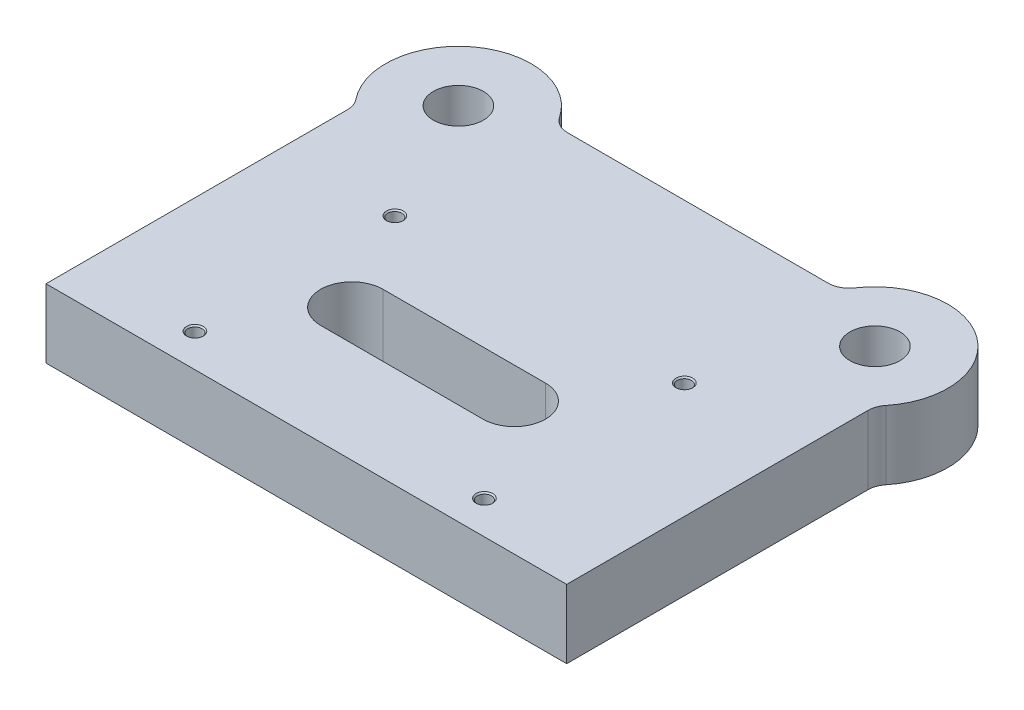
ISO-10303-21;
HEADER;
FILE_DESCRIPTION(('STEP AP214'),'2;1');
FILE_NAME('part.step','',(''),(''),'','','');
FILE_SCHEMA(('AUTOMOTIVE_DESIGN { 1 0 10303 214 1 1 1 1 }'));
ENDSEC;
DATA;
#1=APPLICATION_CONTEXT('core data for automotive mechanical design processes');
#2=APPLICATION_PROTOCOL_DEFINITION('international standard','automotive_design',2000,#1);
#3=PRODUCT_CONTEXT('',#1,'mechanical');
#4=PRODUCT('Part','Part','',(#3));
#5=PRODUCT_RELATED_PRODUCT_CATEGORY('part','',(#4));
#6=PRODUCT_DEFINITION_FORMATION('','',#4);
#7=PRODUCT_DEFINITION_CONTEXT('part definition',#1,'design');
#8=PRODUCT_DEFINITION('design','',#6,#7);
#9=PRODUCT_DEFINITION_SHAPE('','',#8);
#10=(LENGTH_UNIT() NAMED_UNIT(*) SI_UNIT(.MILLI.,.METRE.));
#11=(NAMED_UNIT(*) PLANE_ANGLE_UNIT() SI_UNIT($,.RADIAN.));
#12=(NAMED_UNIT(*) SI_UNIT($,.STERADIAN.) SOLID_ANGLE_UNIT());
#13=UNCERTAINTY_MEASURE_WITH_UNIT(LENGTH_MEASURE(1.E-05),#10,'distance_accuracy_value','');
#14=(GEOMETRIC_REPRESENTATION_CONTEXT(3) GLOBAL_UNCERTAINTY_ASSIGNED_CONTEXT((#13)) GLOBAL_UNIT_ASSIGNED_CONTEXT((#10,
#11,#12)) REPRESENTATION_CONTEXT('',''));
#15=CARTESIAN_POINT('',(0.,0.,0.));
#16=DIRECTION('',(0.,0.,1.));
#17=DIRECTION('',(1.,0.,0.));
#18=AXIS2_PLACEMENT_3D('',#15,#16,#17);
#19=CARTESIAN_POINT('',(-100.,33.,-173.));
#20=DIRECTION('',(0.,1.,0.));
#21=DIRECTION('',(0.,0.,1.));
#22=AXIS2_PLACEMENT_3D('',#19,#20,#21);
#23=PLANE('',#22);
#24=CARTESIAN_POINT('',(-41.7730554338695,33.,-63.6023744671545));
#25=DIRECTION('',(0.,1.,0.));
#26=DIRECTION('',(0.,0.,1.));
#27=AXIS2_PLACEMENT_3D('',#24,#25,#26);
#28=CIRCLE('',#27,15.);
#29=CARTESIAN_POINT('',(-41.7730554338695,33.,-78.6023744671545));
#30=VERTEX_POINT('',#29);
#31=CARTESIAN_POINT('',(-41.7730554338695,33.,-48.6023744671544));
#32=VERTEX_POINT('',#31);
#33=EDGE_CURVE('E55',#30,#32,#28,.T.);
#34=ORIENTED_EDGE('',*,*,#33,.F.);
#35=DIRECTION('',(-1.,0.,0.));
#36=VECTOR('',#35,1.);
#37=CARTESIAN_POINT('',(-41.7730554338695,33.,-78.6023744671545));
#38=LINE('',#37,#36);
#39=CARTESIAN_POINT('',(36.2269445661305,33.,-78.6023744671545));
#40=VERTEX_POINT('',#39);
#41=EDGE_CURVE('E149',#40,#30,#38,.T.);
#42=ORIENTED_EDGE('',*,*,#41,.F.);
#43=CARTESIAN_POINT('',(36.2269445661305,33.,-63.6023744671545));
#44=DIRECTION('',(0.,1.,0.));
#45=DIRECTION('',(0.,0.,1.));
#46=AXIS2_PLACEMENT_3D('',#43,#44,#45);
#47=CIRCLE('',#46,15.);
#48=CARTESIAN_POINT('',(36.2269445661305,33.,-48.6023744671544));
#49=VERTEX_POINT('',#48);
#50=EDGE_CURVE('E176',#49,#40,#47,.T.);
#51=ORIENTED_EDGE('',*,*,#50,.F.);
#52=DIRECTION('',(1.,0.,0.));
#53=VECTOR('',#52,1.);
#54=CARTESIAN_POINT('',(-41.7730554338695,33.,-48.6023744671544));
#55=LINE('',#54,#53);
#56=EDGE_CURVE('E168',#32,#49,#55,.T.);
#57=ORIENTED_EDGE('',*,*,#56,.F.);
#58=EDGE_LOOP('',(#34,#42,#51,#57));
#59=FACE_BOUND('',#58,.T.);
#60=CARTESIAN_POINT('',(-69.5,33.,-112.));
#61=DIRECTION('',(0.,1.,0.));
#62=DIRECTION('',(0.,0.,1.));
#63=AXIS2_PLACEMENT_3D('',#60,#61,#62);
#64=CIRCLE('',#63,4.025);
#65=CARTESIAN_POINT('',(-69.5,33.,-107.975));
#66=VERTEX_POINT('',#65);
#67=EDGE_CURVE('E156',#66,#66,#64,.T.);
#68=ORIENTED_EDGE('',*,*,#67,.F.);
#69=EDGE_LOOP('',(#68));
#70=FACE_BOUND('',#69,.T.);
#71=CARTESIAN_POINT('',(69.5,33.,-112.));
#72=DIRECTION('',(0.,1.,0.));
#73=DIRECTION('',(0.,0.,1.));
#74=AXIS2_PLACEMENT_3D('',#71,#72,#73);
#75=CIRCLE('',#74,4.025);
#76=CARTESIAN_POINT('',(69.5,33.,-107.975));
#77=VERTEX_POINT('',#76);
#78=EDGE_CURVE('E201',#77,#77,#75,.T.);
#79=ORIENTED_EDGE('',*,*,#78,.F.);
#80=EDGE_LOOP('',(#79));
#81=FACE_BOUND('',#80,.T.);
#82=CARTESIAN_POINT('',(69.5,33.,-16.));
#83=DIRECTION('',(0.,1.,0.));
#84=DIRECTION('',(0.,0.,1.));
#85=AXIS2_PLACEMENT_3D('',#82,#83,#84);
#86=CIRCLE('',#85,4.025);
#87=CARTESIAN_POINT('',(69.5,33.,-11.975));
#88=VERTEX_POINT('',#87);
#89=EDGE_CURVE('E213',#88,#88,#86,.T.);
#90=ORIENTED_EDGE('',*,*,#89,.F.);
#91=EDGE_LOOP('',(#90));
#92=FACE_BOUND('',#91,.T.);
#93=CARTESIAN_POINT('',(-69.5,33.,-16.));
#94=DIRECTION('',(0.,1.,0.));
#95=DIRECTION('',(0.,0.,1.));
#96=AXIS2_PLACEMENT_3D('',#93,#94,#95);
#97=CIRCLE('',#96,4.025);
#98=CARTESIAN_POINT('',(-69.5,33.,-11.975));
#99=VERTEX_POINT('',#98);
#100=EDGE_CURVE('E224',#99,#99,#97,.T.);
#101=ORIENTED_EDGE('',*,*,#100,.F.);
#102=EDGE_LOOP('',(#101));
#103=FACE_BOUND('',#102,.T.);
#104=CARTESIAN_POINT('',(-100.,33.,-173.));
#105=DIRECTION('',(0.,1.,0.));
#106=DIRECTION('',(0.,0.,1.));
#107=AXIS2_PLACEMENT_3D('',#104,#105,#106);
#108=CIRCLE('',#107,12.);
#109=CARTESIAN_POINT('',(-100.,33.,-161.));
#110=VERTEX_POINT('',#109);
#111=EDGE_CURVE('E245',#110,#110,#108,.T.);
#112=ORIENTED_EDGE('',*,*,#111,.F.);
#113=EDGE_LOOP('',(#112));
#114=FACE_BOUND('',#113,.T.);
#115=CARTESIAN_POINT('',(-100.,33.,-173.));
#116=DIRECTION('',(0.,1.,0.));
#117=DIRECTION('',(0.,0.,1.));
#118=AXIS2_PLACEMENT_3D('',#115,#116,#117);
#119=CIRCLE('',#118,35.);
#120=CARTESIAN_POINT('',(-70.8982203250916,33.,-192.444444444444));
#121=VERTEX_POINT('',#120);
#122=CARTESIAN_POINT('',(-127.222222222222,33.,-151.001122363085));
#123=VERTEX_POINT('',#122);
#124=EDGE_CURVE('E272',#121,#123,#119,.T.);
#125=ORIENTED_EDGE('',*,*,#124,.T.);
#126=CARTESIAN_POINT('',(-135.,33.,-144.715728752538));
#127=DIRECTION('',(0.,1.,0.));
#128=DIRECTION('',(0.,0.,1.));
#129=AXIS2_PLACEMENT_3D('',#126,#127,#128);
#130=CIRCLE('',#129,10.);
#131=CARTESIAN_POINT('',(-125.,33.,-144.715728752538));
#132=VERTEX_POINT('',#131);
#133=EDGE_CURVE('E11',#123,#132,#130,.F.);
#134=ORIENTED_EDGE('',*,*,#133,.T.);
#135=DIRECTION('',(0.,0.,1.));
#136=VECTOR('',#135,1.);
#137=CARTESIAN_POINT('',(-125.,33.,0.));
#138=LINE('',#137,#136);
#139=CARTESIAN_POINT('',(-125.,33.,0.));
#140=VERTEX_POINT('',#139);
#141=EDGE_CURVE('E253',#132,#140,#138,.T.);
#142=ORIENTED_EDGE('',*,*,#141,.T.);
#143=DIRECTION('',(1.,0.,0.));
#144=VECTOR('',#143,1.);
#145=CARTESIAN_POINT('',(125.,33.,0.));
#146=LINE('',#145,#144);
#147=CARTESIAN_POINT('',(125.,33.,0.));
#148=VERTEX_POINT('',#147);
#149=EDGE_CURVE('E256',#140,#148,#146,.T.);
#150=ORIENTED_EDGE('',*,*,#149,.T.);
#151=DIRECTION('',(0.,0.,-1.));
#152=VECTOR('',#151,1.);
#153=CARTESIAN_POINT('',(125.,33.,0.));
#154=LINE('',#153,#152);
#155=CARTESIAN_POINT('',(125.,33.,-144.715728752538));
#156=VERTEX_POINT('',#155);
#157=EDGE_CURVE('E260',#148,#156,#154,.T.);
#158=ORIENTED_EDGE('',*,*,#157,.T.);
#159=CARTESIAN_POINT('',(135.,33.,-144.715728752538));
#160=DIRECTION('',(0.,1.,0.));
#161=DIRECTION('',(0.,0.,1.));
#162=AXIS2_PLACEMENT_3D('',#159,#160,#161);
#163=CIRCLE('',#162,10.);
#164=CARTESIAN_POINT('',(127.222222222222,33.,-151.001122363085));
#165=VERTEX_POINT('',#164);
#166=EDGE_CURVE('E335',#156,#165,#163,.F.);
#167=ORIENTED_EDGE('',*,*,#166,.T.);
#168=CARTESIAN_POINT('',(100.,33.,-173.));
#169=DIRECTION('',(0.,1.,0.));
#170=DIRECTION('',(0.,0.,-1.));
#171=AXIS2_PLACEMENT_3D('',#168,#169,#170);
#172=CIRCLE('',#171,35.);
#173=CARTESIAN_POINT('',(70.8982203250916,33.,-192.444444444444));
#174=VERTEX_POINT('',#173);
#175=EDGE_CURVE('E264',#165,#174,#172,.T.);
#176=ORIENTED_EDGE('',*,*,#175,.T.);
#177=CARTESIAN_POINT('',(62.5834261322606,33.,-198.));
#178=DIRECTION('',(0.,1.,0.));
#179=DIRECTION('',(0.,0.,1.));
#180=AXIS2_PLACEMENT_3D('',#177,#178,#179);
#181=CIRCLE('',#180,10.);
#182=CARTESIAN_POINT('',(62.5834261322606,33.,-188.));
#183=VERTEX_POINT('',#182);
#184=EDGE_CURVE('E340',#174,#183,#181,.F.);
#185=ORIENTED_EDGE('',*,*,#184,.T.);
#186=DIRECTION('',(-1.,0.,0.));
#187=VECTOR('',#186,1.);
#188=CARTESIAN_POINT('',(68.3772233983162,33.,-188.));
#189=LINE('',#188,#187);
#190=CARTESIAN_POINT('',(-62.5834261322606,33.,-188.));
#191=VERTEX_POINT('',#190);
#192=EDGE_CURVE('E268',#183,#191,#189,.T.);
#193=ORIENTED_EDGE('',*,*,#192,.T.);
#194=CARTESIAN_POINT('',(-62.5834261322606,33.,-198.));
#195=DIRECTION('',(0.,1.,0.));
#196=DIRECTION('',(0.,0.,1.));
#197=AXIS2_PLACEMENT_3D('',#194,#195,#196);
#198=CIRCLE('',#197,10.);
#199=EDGE_CURVE('E346',#191,#121,#198,.F.);
#200=ORIENTED_EDGE('',*,*,#199,.T.);
#201=EDGE_LOOP('',(#125,#134,#142,#150,#158,#167,#176,#185,#193,#200));
#202=FACE_BOUND('',#201,.T.);
#203=CARTESIAN_POINT('',(100.,33.,-173.));
#204=DIRECTION('',(0.,1.,0.));
#205=DIRECTION('',(0.,0.,-1.));
#206=AXIS2_PLACEMENT_3D('',#203,#204,#205);
#207=CIRCLE('',#206,12.);
#208=CARTESIAN_POINT('',(100.,33.,-185.));
#209=VERTEX_POINT('',#208);
#210=EDGE_CURVE('E237',#209,#209,#207,.T.);
#211=ORIENTED_EDGE('',*,*,#210,.F.);
#212=EDGE_LOOP('',(#211));
#213=FACE_BOUND('',#212,.T.);
#214=ADVANCED_FACE('F39',(#59,#70,#81,#92,#103,#114,#202,#213),#23,.T.);
#215=CARTESIAN_POINT('',(-100.,0.,-173.));
#216=DIRECTION('',(0.,1.,0.));
#217=DIRECTION('',(0.,0.,1.));
#218=AXIS2_PLACEMENT_3D('',#215,#216,#217);
#219=PLANE('',#218);
#220=DIRECTION('',(1.,0.,0.));
#221=VECTOR('',#220,1.);
#222=CARTESIAN_POINT('',(-41.7730554338695,0.,-78.6023744671545));
#223=LINE('',#222,#221);
#224=CARTESIAN_POINT('',(-41.7730554338695,0.,-78.6023744671545));
#225=VERTEX_POINT('',#224);
#226=CARTESIAN_POINT('',(36.2269445661305,0.,-78.6023744671545));
#227=VERTEX_POINT('',#226);
#228=EDGE_CURVE('E162',#225,#227,#223,.T.);
#229=ORIENTED_EDGE('',*,*,#228,.F.);
#230=CARTESIAN_POINT('',(-41.7730554338695,0.,-63.6023744671545));
#231=DIRECTION('',(0.,1.,0.));
#232=DIRECTION('',(0.,0.,1.));
#233=AXIS2_PLACEMENT_3D('',#230,#231,#232);
#234=CIRCLE('',#233,15.);
#235=CARTESIAN_POINT('',(-41.7730554338695,0.,-48.6023744671544));
#236=VERTEX_POINT('',#235);
#237=EDGE_CURVE('E142',#236,#225,#234,.F.);
#238=ORIENTED_EDGE('',*,*,#237,.F.);
#239=DIRECTION('',(-1.,0.,0.));
#240=VECTOR('',#239,1.);
#241=CARTESIAN_POINT('',(-41.7730554338695,0.,-48.6023744671544));
#242=LINE('',#241,#240);
#243=CARTESIAN_POINT('',(36.2269445661305,0.,-48.6023744671544));
#244=VERTEX_POINT('',#243);
#245=EDGE_CURVE('E152',#244,#236,#242,.T.);
#246=ORIENTED_EDGE('',*,*,#245,.F.);
#247=CARTESIAN_POINT('',(36.2269445661305,0.,-63.6023744671545));
#248=DIRECTION('',(0.,1.,0.));
#249=DIRECTION('',(0.,0.,1.));
#250=AXIS2_PLACEMENT_3D('',#247,#248,#249);
#251=CIRCLE('',#250,15.);
#252=EDGE_CURVE('E63',#227,#244,#251,.F.);
#253=ORIENTED_EDGE('',*,*,#252,.F.);
#254=EDGE_LOOP('',(#229,#238,#246,#253));
#255=FACE_BOUND('',#254,.T.);
#256=CARTESIAN_POINT('',(-69.5,0.,-112.));
#257=DIRECTION('',(0.,1.,0.));
#258=DIRECTION('',(0.,0.,1.));
#259=AXIS2_PLACEMENT_3D('',#256,#257,#258);
#260=CIRCLE('',#259,3.39999999999999);
#261=CARTESIAN_POINT('',(-69.5,0.,-108.6));
#262=VERTEX_POINT('',#261);
#263=EDGE_CURVE('E197',#262,#262,#260,.T.);
#264=ORIENTED_EDGE('',*,*,#263,.T.);
#265=EDGE_LOOP('',(#264));
#266=FACE_BOUND('',#265,.T.);
#267=CARTESIAN_POINT('',(69.5,0.,-112.));
#268=DIRECTION('',(0.,1.,0.));
#269=DIRECTION('',(0.,0.,1.));
#270=AXIS2_PLACEMENT_3D('',#267,#268,#269);
#271=CIRCLE('',#270,3.39999999999999);
#272=CARTESIAN_POINT('',(69.5,0.,-108.6));
#273=VERTEX_POINT('',#272);
#274=EDGE_CURVE('E209',#273,#273,#271,.T.);
#275=ORIENTED_EDGE('',*,*,#274,.T.);
#276=EDGE_LOOP('',(#275));
#277=FACE_BOUND('',#276,.T.);
#278=CARTESIAN_POINT('',(69.5,0.,-16.));
#279=DIRECTION('',(0.,1.,0.));
#280=DIRECTION('',(0.,0.,1.));
#281=AXIS2_PLACEMENT_3D('',#278,#279,#280);
#282=CIRCLE('',#281,3.39999999999999);
#283=CARTESIAN_POINT('',(69.5,0.,-12.6));
#284=VERTEX_POINT('',#283);
#285=EDGE_CURVE('E221',#284,#284,#282,.T.);
#286=ORIENTED_EDGE('',*,*,#285,.T.);
#287=EDGE_LOOP('',(#286));
#288=FACE_BOUND('',#287,.T.);
#289=CARTESIAN_POINT('',(-69.5,0.,-16.));
#290=DIRECTION('',(0.,1.,0.));
#291=DIRECTION('',(0.,0.,1.));
#292=AXIS2_PLACEMENT_3D('',#289,#290,#291);
#293=CIRCLE('',#292,3.39999999999999);
#294=CARTESIAN_POINT('',(-69.5,0.,-12.6));
#295=VERTEX_POINT('',#294);
#296=EDGE_CURVE('E232',#295,#295,#293,.T.);
#297=ORIENTED_EDGE('',*,*,#296,.T.);
#298=EDGE_LOOP('',(#297));
#299=FACE_BOUND('',#298,.T.);
#300=DIRECTION('',(0.,0.,1.));
#301=VECTOR('',#300,1.);
#302=CARTESIAN_POINT('',(-125.,0.,0.));
#303=LINE('',#302,#301);
#304=CARTESIAN_POINT('',(-125.,0.,-144.715728752538));
#305=VERTEX_POINT('',#304);
#306=CARTESIAN_POINT('',(-125.,0.,0.));
#307=VERTEX_POINT('',#306);
#308=EDGE_CURVE('E249',#305,#307,#303,.T.);
#309=ORIENTED_EDGE('',*,*,#308,.F.);
#310=CARTESIAN_POINT('',(-135.,0.,-144.715728752538));
#311=DIRECTION('',(0.,1.,0.));
#312=DIRECTION('',(0.,0.,1.));
#313=AXIS2_PLACEMENT_3D('',#310,#311,#312);
#314=CIRCLE('',#313,10.);
#315=CARTESIAN_POINT('',(-127.222222222222,0.,-151.001122363085));
#316=VERTEX_POINT('',#315);
#317=EDGE_CURVE('E48',#305,#316,#314,.T.);
#318=ORIENTED_EDGE('',*,*,#317,.T.);
#319=CARTESIAN_POINT('',(-100.,0.,-173.));
#320=DIRECTION('',(0.,1.,0.));
#321=DIRECTION('',(0.,0.,1.));
#322=AXIS2_PLACEMENT_3D('',#319,#320,#321);
#323=CIRCLE('',#322,35.);
#324=CARTESIAN_POINT('',(-70.8982203250916,0.,-192.444444444444));
#325=VERTEX_POINT('',#324);
#326=EDGE_CURVE('E257',#325,#316,#323,.T.);
#327=ORIENTED_EDGE('',*,*,#326,.F.);
#328=CARTESIAN_POINT('',(-62.5834261322606,0.,-198.));
#329=DIRECTION('',(0.,1.,0.));
#330=DIRECTION('',(0.,0.,1.));
#331=AXIS2_PLACEMENT_3D('',#328,#329,#330);
#332=CIRCLE('',#331,10.);
#333=CARTESIAN_POINT('',(-62.5834261322606,0.,-188.));
#334=VERTEX_POINT('',#333);
#335=EDGE_CURVE('E343',#325,#334,#332,.T.);
#336=ORIENTED_EDGE('',*,*,#335,.T.);
#337=DIRECTION('',(-1.,0.,0.));
#338=VECTOR('',#337,1.);
#339=CARTESIAN_POINT('',(68.3772233983162,0.,-188.));
#340=LINE('',#339,#338);
#341=CARTESIAN_POINT('',(62.5834261322606,0.,-188.));
#342=VERTEX_POINT('',#341);
#343=EDGE_CURVE('E290',#342,#334,#340,.T.);
#344=ORIENTED_EDGE('',*,*,#343,.F.);
#345=CARTESIAN_POINT('',(62.5834261322606,0.,-198.));
#346=DIRECTION('',(0.,1.,0.));
#347=DIRECTION('',(0.,0.,1.));
#348=AXIS2_PLACEMENT_3D('',#345,#346,#347);
#349=CIRCLE('',#348,10.);
#350=CARTESIAN_POINT('',(70.8982203250916,0.,-192.444444444444));
#351=VERTEX_POINT('',#350);
#352=EDGE_CURVE('E338',#342,#351,#349,.T.);
#353=ORIENTED_EDGE('',*,*,#352,.T.);
#354=CARTESIAN_POINT('',(100.,0.,-173.));
#355=DIRECTION('',(0.,1.,0.));
#356=DIRECTION('',(0.,0.,-1.));
#357=AXIS2_PLACEMENT_3D('',#354,#355,#356);
#358=CIRCLE('',#357,35.);
#359=CARTESIAN_POINT('',(127.222222222222,0.,-151.001122363085));
#360=VERTEX_POINT('',#359);
#361=EDGE_CURVE('E286',#360,#351,#358,.T.);
#362=ORIENTED_EDGE('',*,*,#361,.F.);
#363=CARTESIAN_POINT('',(135.,0.,-144.715728752538));
#364=DIRECTION('',(0.,1.,0.));
#365=DIRECTION('',(0.,0.,1.));
#366=AXIS2_PLACEMENT_3D('',#363,#364,#365);
#367=CIRCLE('',#366,10.);
#368=CARTESIAN_POINT('',(125.,0.,-144.715728752538));
#369=VERTEX_POINT('',#368);
#370=EDGE_CURVE('E332',#360,#369,#367,.T.);
#371=ORIENTED_EDGE('',*,*,#370,.T.);
#372=DIRECTION('',(0.,0.,-1.));
#373=VECTOR('',#372,1.);
#374=CARTESIAN_POINT('',(125.,0.,0.));
#375=LINE('',#374,#373);
#376=CARTESIAN_POINT('',(125.,0.,0.));
#377=VERTEX_POINT('',#376);
#378=EDGE_CURVE('E282',#377,#369,#375,.T.);
#379=ORIENTED_EDGE('',*,*,#378,.F.);
#380=DIRECTION('',(1.,0.,0.));
#381=VECTOR('',#380,1.);
#382=CARTESIAN_POINT('',(125.,0.,0.));
#383=LINE('',#382,#381);
#384=EDGE_CURVE('E279',#307,#377,#383,.T.);
#385=ORIENTED_EDGE('',*,*,#384,.F.);
#386=EDGE_LOOP('',(#309,#318,#327,#336,#344,#353,#362,#371,#379,#385));
#387=FACE_BOUND('',#386,.T.);
#388=CARTESIAN_POINT('',(-100.,0.,-173.));
#389=DIRECTION('',(0.,1.,0.));
#390=DIRECTION('',(0.,0.,1.));
#391=AXIS2_PLACEMENT_3D('',#388,#389,#390);
#392=CIRCLE('',#391,12.);
#393=CARTESIAN_POINT('',(-100.,0.,-161.));
#394=VERTEX_POINT('',#393);
#395=EDGE_CURVE('E241',#394,#394,#392,.T.);
#396=ORIENTED_EDGE('',*,*,#395,.T.);
#397=EDGE_LOOP('',(#396));
#398=FACE_BOUND('',#397,.T.);
#399=CARTESIAN_POINT('',(100.,0.,-173.));
#400=DIRECTION('',(0.,1.,0.));
#401=DIRECTION('',(0.,0.,-1.));
#402=AXIS2_PLACEMENT_3D('',#399,#400,#401);
#403=CIRCLE('',#402,12.);
#404=CARTESIAN_POINT('',(100.,0.,-185.));
#405=VERTEX_POINT('',#404);
#406=EDGE_CURVE('E236',#405,#405,#403,.T.);
#407=ORIENTED_EDGE('',*,*,#406,.T.);
#408=EDGE_LOOP('',(#407));
#409=FACE_BOUND('',#408,.T.);
#410=ADVANCED_FACE('F159',(#255,#266,#277,#288,#299,#387,#398,#409),#219,.F.);
#411=CARTESIAN_POINT('',(-125.,33.,0.));
#412=DIRECTION('',(1.,0.,0.));
#413=DIRECTION('',(0.,0.,-1.));
#414=AXIS2_PLACEMENT_3D('',#411,#412,#413);
#415=PLANE('',#414);
#416=ORIENTED_EDGE('',*,*,#141,.F.);
#417=DIRECTION('',(0.,1.,0.));
#418=VECTOR('',#417,1.);
#419=CARTESIAN_POINT('',(-125.,0.,-144.715728752538));
#420=LINE('',#419,#418);
#421=EDGE_CURVE('E328',#132,#305,#420,.F.);
#422=ORIENTED_EDGE('',*,*,#421,.T.);
#423=ORIENTED_EDGE('',*,*,#308,.T.);
#424=DIRECTION('',(0.,-1.,0.));
#425=VECTOR('',#424,1.);
#426=CARTESIAN_POINT('',(-125.,33.,0.));
#427=LINE('',#426,#425);
#428=EDGE_CURVE('E300',#140,#307,#427,.T.);
#429=ORIENTED_EDGE('',*,*,#428,.F.);
#430=EDGE_LOOP('',(#416,#422,#423,#429));
#431=FACE_BOUND('',#430,.T.);
#432=ADVANCED_FACE('F369',(#431),#415,.F.);
#433=CARTESIAN_POINT('',(125.,33.,0.));
#434=DIRECTION('',(0.,0.,-1.));
#435=DIRECTION('',(-1.,0.,0.));
#436=AXIS2_PLACEMENT_3D('',#433,#434,#435);
#437=PLANE('',#436);
#438=ORIENTED_EDGE('',*,*,#384,.T.);
#439=DIRECTION('',(0.,-1.,0.));
#440=VECTOR('',#439,1.);
#441=CARTESIAN_POINT('',(125.,33.,0.));
#442=LINE('',#441,#440);
#443=EDGE_CURVE('E276',#148,#377,#442,.T.);
#444=ORIENTED_EDGE('',*,*,#443,.F.);
#445=ORIENTED_EDGE('',*,*,#149,.F.);
#446=ORIENTED_EDGE('',*,*,#428,.T.);
#447=EDGE_LOOP('',(#438,#444,#445,#446));
#448=FACE_BOUND('',#447,.T.);
#449=ADVANCED_FACE('F371',(#448),#437,.F.);
#450=CARTESIAN_POINT('',(125.,33.,0.));
#451=DIRECTION('',(-1.,0.,0.));
#452=DIRECTION('',(0.,0.,1.));
#453=AXIS2_PLACEMENT_3D('',#450,#451,#452);
#454=PLANE('',#453);
#455=ORIENTED_EDGE('',*,*,#378,.T.);
#456=DIRECTION('',(0.,1.,0.));
#457=VECTOR('',#456,1.);
#458=CARTESIAN_POINT('',(125.,33.,-144.715728752538));
#459=LINE('',#458,#457);
#460=EDGE_CURVE('E311',#369,#156,#459,.T.);
#461=ORIENTED_EDGE('',*,*,#460,.T.);
#462=ORIENTED_EDGE('',*,*,#157,.F.);
#463=ORIENTED_EDGE('',*,*,#443,.T.);
#464=EDGE_LOOP('',(#455,#461,#462,#463));
#465=FACE_BOUND('',#464,.T.);
#466=ADVANCED_FACE('F421',(#465),#454,.F.);
#467=CARTESIAN_POINT('',(100.,33.,-173.));
#468=DIRECTION('',(0.,-1.,0.));
#469=DIRECTION('',(0.,0.,-1.));
#470=AXIS2_PLACEMENT_3D('',#467,#468,#469);
#471=CYLINDRICAL_SURFACE('',#470,35.);
#472=ORIENTED_EDGE('',*,*,#175,.F.);
#473=DIRECTION('',(0.,-1.,0.));
#474=VECTOR('',#473,1.);
#475=CARTESIAN_POINT('',(127.222222222222,33.,-151.001122363085));
#476=LINE('',#475,#474);
#477=EDGE_CURVE('E307',#165,#360,#476,.T.);
#478=ORIENTED_EDGE('',*,*,#477,.T.);
#479=ORIENTED_EDGE('',*,*,#361,.T.);
#480=DIRECTION('',(0.,-1.,0.));
#481=VECTOR('',#480,1.);
#482=CARTESIAN_POINT('',(70.8982203250916,33.,-192.444444444444));
#483=LINE('',#482,#481);
#484=EDGE_CURVE('E304',#351,#174,#483,.F.);
#485=ORIENTED_EDGE('',*,*,#484,.T.);
#486=EDGE_LOOP('',(#472,#478,#479,#485));
#487=FACE_BOUND('',#486,.T.);
#488=ADVANCED_FACE('F383',(#487),#471,.T.);
#489=CARTESIAN_POINT('',(68.3772233983162,33.,-188.));
#490=DIRECTION('',(0.,0.,1.));
#491=DIRECTION('',(1.,0.,0.));
#492=AXIS2_PLACEMENT_3D('',#489,#490,#491);
#493=PLANE('',#492);
#494=ORIENTED_EDGE('',*,*,#192,.F.);
#495=DIRECTION('',(0.,1.,0.));
#496=VECTOR('',#495,1.);
#497=CARTESIAN_POINT('',(62.5834261322606,0.,-188.));
#498=LINE('',#497,#496);
#499=EDGE_CURVE('E317',#183,#342,#498,.F.);
#500=ORIENTED_EDGE('',*,*,#499,.T.);
#501=ORIENTED_EDGE('',*,*,#343,.T.);
#502=DIRECTION('',(0.,1.,0.));
#503=VECTOR('',#502,1.);
#504=CARTESIAN_POINT('',(-62.5834261322606,33.,-188.));
#505=LINE('',#504,#503);
#506=EDGE_CURVE('E314',#334,#191,#505,.T.);
#507=ORIENTED_EDGE('',*,*,#506,.T.);
#508=EDGE_LOOP('',(#494,#500,#501,#507));
#509=FACE_BOUND('',#508,.T.);
#510=ADVANCED_FACE('F393',(#509),#493,.F.);
#511=CARTESIAN_POINT('',(-100.,33.,-173.));
#512=DIRECTION('',(0.,-1.,0.));
#513=DIRECTION('',(0.,0.,-1.));
#514=AXIS2_PLACEMENT_3D('',#511,#512,#513);
#515=CYLINDRICAL_SURFACE('',#514,35.);
#516=ORIENTED_EDGE('',*,*,#124,.F.);
#517=DIRECTION('',(0.,-1.,0.));
#518=VECTOR('',#517,1.);
#519=CARTESIAN_POINT('',(-70.8982203250916,33.,-192.444444444444));
#520=LINE('',#519,#518);
#521=EDGE_CURVE('E324',#121,#325,#520,.T.);
#522=ORIENTED_EDGE('',*,*,#521,.T.);
#523=ORIENTED_EDGE('',*,*,#326,.T.);
#524=DIRECTION('',(0.,-1.,0.));
#525=VECTOR('',#524,1.);
#526=CARTESIAN_POINT('',(-127.222222222222,33.,-151.001122363085));
#527=LINE('',#526,#525);
#528=EDGE_CURVE('E321',#316,#123,#527,.F.);
#529=ORIENTED_EDGE('',*,*,#528,.T.);
#530=EDGE_LOOP('',(#516,#522,#523,#529));
#531=FACE_BOUND('',#530,.T.);
#532=ADVANCED_FACE('F360',(#531),#515,.T.);
#533=CARTESIAN_POINT('',(-100.,33.,-173.));
#534=DIRECTION('',(0.,-1.,0.));
#535=DIRECTION('',(0.,0.,-1.));
#536=AXIS2_PLACEMENT_3D('',#533,#534,#535);
#537=CYLINDRICAL_SURFACE('',#536,12.);
#538=ORIENTED_EDGE('',*,*,#111,.T.);
#539=EDGE_LOOP('',(#538));
#540=FACE_BOUND('',#539,.T.);
#541=ORIENTED_EDGE('',*,*,#395,.F.);
#542=EDGE_LOOP('',(#541));
#543=FACE_BOUND('',#542,.T.);
#544=ADVANCED_FACE('F412',(#540,#543),#537,.F.);
#545=CARTESIAN_POINT('',(100.,33.,-173.));
#546=DIRECTION('',(0.,-1.,0.));
#547=DIRECTION('',(0.,0.,-1.));
#548=AXIS2_PLACEMENT_3D('',#545,#546,#547);
#549=CYLINDRICAL_SURFACE('',#548,12.);
#550=ORIENTED_EDGE('',*,*,#210,.T.);
#551=EDGE_LOOP('',(#550));
#552=FACE_BOUND('',#551,.T.);
#553=ORIENTED_EDGE('',*,*,#406,.F.);
#554=EDGE_LOOP('',(#553));
#555=FACE_BOUND('',#554,.T.);
#556=ADVANCED_FACE('F429',(#552,#555),#549,.F.);
#557=CARTESIAN_POINT('',(135.,33.,-144.715728752538));
#558=DIRECTION('',(0.,-1.,0.));
#559=DIRECTION('',(0.,0.,-1.));
#560=AXIS2_PLACEMENT_3D('',#557,#558,#559);
#561=CYLINDRICAL_SURFACE('',#560,10.);
#562=ORIENTED_EDGE('',*,*,#166,.F.);
#563=ORIENTED_EDGE('',*,*,#460,.F.);
#564=ORIENTED_EDGE('',*,*,#370,.F.);
#565=ORIENTED_EDGE('',*,*,#477,.F.);
#566=EDGE_LOOP('',(#562,#563,#564,#565));
#567=FACE_BOUND('',#566,.T.);
#568=ADVANCED_FACE('F380',(#567),#561,.F.);
#569=CARTESIAN_POINT('',(62.5834261322606,33.,-198.));
#570=DIRECTION('',(0.,-1.,0.));
#571=DIRECTION('',(0.,0.,-1.));
#572=AXIS2_PLACEMENT_3D('',#569,#570,#571);
#573=CYLINDRICAL_SURFACE('',#572,10.);
#574=ORIENTED_EDGE('',*,*,#184,.F.);
#575=ORIENTED_EDGE('',*,*,#484,.F.);
#576=ORIENTED_EDGE('',*,*,#352,.F.);
#577=ORIENTED_EDGE('',*,*,#499,.F.);
#578=EDGE_LOOP('',(#574,#575,#576,#577));
#579=FACE_BOUND('',#578,.T.);
#580=ADVANCED_FACE('F390',(#579),#573,.F.);
#581=CARTESIAN_POINT('',(-62.5834261322606,33.,-198.));
#582=DIRECTION('',(0.,-1.,0.));
#583=DIRECTION('',(0.,0.,-1.));
#584=AXIS2_PLACEMENT_3D('',#581,#582,#583);
#585=CYLINDRICAL_SURFACE('',#584,10.);
#586=ORIENTED_EDGE('',*,*,#199,.F.);
#587=ORIENTED_EDGE('',*,*,#506,.F.);
#588=ORIENTED_EDGE('',*,*,#335,.F.);
#589=ORIENTED_EDGE('',*,*,#521,.F.);
#590=EDGE_LOOP('',(#586,#587,#588,#589));
#591=FACE_BOUND('',#590,.T.);
#592=ADVANCED_FACE('F397',(#591),#585,.F.);
#593=CARTESIAN_POINT('',(-135.,33.,-144.715728752538));
#594=DIRECTION('',(0.,-1.,0.));
#595=DIRECTION('',(0.,0.,-1.));
#596=AXIS2_PLACEMENT_3D('',#593,#594,#595);
#597=CYLINDRICAL_SURFACE('',#596,10.);
#598=ORIENTED_EDGE('',*,*,#133,.F.);
#599=ORIENTED_EDGE('',*,*,#528,.F.);
#600=ORIENTED_EDGE('',*,*,#317,.F.);
#601=ORIENTED_EDGE('',*,*,#421,.F.);
#602=EDGE_LOOP('',(#598,#599,#600,#601));
#603=FACE_BOUND('',#602,.T.);
#604=ADVANCED_FACE('F41',(#603),#597,.F.);
#605=CARTESIAN_POINT('',(-69.5,33.,-16.));
#606=DIRECTION('',(0.,1.,0.));
#607=DIRECTION('',(0.,0.,1.));
#608=AXIS2_PLACEMENT_3D('',#605,#606,#607);
#609=CYLINDRICAL_SURFACE('',#608,3.39999999999999);
#610=ORIENTED_EDGE('',*,*,#296,.F.);
#611=EDGE_LOOP('',(#610));
#612=FACE_BOUND('',#611,.T.);
#613=CARTESIAN_POINT('',(-69.5,32.375,-16.));
#614=DIRECTION('',(0.,1.,0.));
#615=DIRECTION('',(0.,0.,1.));
#616=AXIS2_PLACEMENT_3D('',#613,#614,#615);
#617=CIRCLE('',#616,3.4);
#618=CARTESIAN_POINT('',(-69.5,32.375,-12.6));
#619=VERTEX_POINT('',#618);
#620=EDGE_CURVE('E228',#619,#619,#617,.T.);
#621=ORIENTED_EDGE('',*,*,#620,.T.);
#622=EDGE_LOOP('',(#621));
#623=FACE_BOUND('',#622,.T.);
#624=ADVANCED_FACE('F402',(#612,#623),#609,.F.);
#625=CARTESIAN_POINT('',(-69.5,33.,-16.));
#626=DIRECTION('',(0.,1.,0.));
#627=DIRECTION('',(0.,0.,1.));
#628=AXIS2_PLACEMENT_3D('',#625,#626,#627);
#629=CONICAL_SURFACE('',#628,4.025,0.785398163397448);
#630=ORIENTED_EDGE('',*,*,#620,.F.);
#631=EDGE_LOOP('',(#630));
#632=FACE_BOUND('',#631,.T.);
#633=ORIENTED_EDGE('',*,*,#100,.T.);
#634=EDGE_LOOP('',(#633));
#635=FACE_BOUND('',#634,.T.);
#636=ADVANCED_FACE('F440',(#632,#635),#629,.F.);
#637=CARTESIAN_POINT('',(69.5,33.,-16.));
#638=DIRECTION('',(0.,1.,0.));
#639=DIRECTION('',(0.,0.,1.));
#640=AXIS2_PLACEMENT_3D('',#637,#638,#639);
#641=CYLINDRICAL_SURFACE('',#640,3.39999999999999);
#642=ORIENTED_EDGE('',*,*,#285,.F.);
#643=EDGE_LOOP('',(#642));
#644=FACE_BOUND('',#643,.T.);
#645=CARTESIAN_POINT('',(69.5,32.375,-16.));
#646=DIRECTION('',(0.,1.,0.));
#647=DIRECTION('',(0.,0.,1.));
#648=AXIS2_PLACEMENT_3D('',#645,#646,#647);
#649=CIRCLE('',#648,3.4);
#650=CARTESIAN_POINT('',(69.5,32.375,-12.6));
#651=VERTEX_POINT('',#650);
#652=EDGE_CURVE('E217',#651,#651,#649,.T.);
#653=ORIENTED_EDGE('',*,*,#652,.T.);
#654=EDGE_LOOP('',(#653));
#655=FACE_BOUND('',#654,.T.);
#656=ADVANCED_FACE('F444',(#644,#655),#641,.F.);
#657=CARTESIAN_POINT('',(69.5,33.,-16.));
#658=DIRECTION('',(0.,1.,0.));
#659=DIRECTION('',(0.,0.,1.));
#660=AXIS2_PLACEMENT_3D('',#657,#658,#659);
#661=CONICAL_SURFACE('',#660,4.025,0.785398163397448);
#662=ORIENTED_EDGE('',*,*,#652,.F.);
#663=EDGE_LOOP('',(#662));
#664=FACE_BOUND('',#663,.T.);
#665=ORIENTED_EDGE('',*,*,#89,.T.);
#666=EDGE_LOOP('',(#665));
#667=FACE_BOUND('',#666,.T.);
#668=ADVANCED_FACE('F448',(#664,#667),#661,.F.);
#669=CARTESIAN_POINT('',(69.5,33.,-112.));
#670=DIRECTION('',(0.,1.,0.));
#671=DIRECTION('',(0.,0.,1.));
#672=AXIS2_PLACEMENT_3D('',#669,#670,#671);
#673=CYLINDRICAL_SURFACE('',#672,3.39999999999999);
#674=ORIENTED_EDGE('',*,*,#274,.F.);
#675=EDGE_LOOP('',(#674));
#676=FACE_BOUND('',#675,.T.);
#677=CARTESIAN_POINT('',(69.5,32.375,-112.));
#678=DIRECTION('',(0.,1.,0.));
#679=DIRECTION('',(0.,0.,1.));
#680=AXIS2_PLACEMENT_3D('',#677,#678,#679);
#681=CIRCLE('',#680,3.4);
#682=CARTESIAN_POINT('',(69.5,32.375,-108.6));
#683=VERTEX_POINT('',#682);
#684=EDGE_CURVE('E205',#683,#683,#681,.T.);
#685=ORIENTED_EDGE('',*,*,#684,.T.);
#686=EDGE_LOOP('',(#685));
#687=FACE_BOUND('',#686,.T.);
#688=ADVANCED_FACE('F452',(#676,#687),#673,.F.);
#689=CARTESIAN_POINT('',(69.5,33.,-112.));
#690=DIRECTION('',(0.,1.,0.));
#691=DIRECTION('',(0.,0.,1.));
#692=AXIS2_PLACEMENT_3D('',#689,#690,#691);
#693=CONICAL_SURFACE('',#692,4.025,0.785398163397448);
#694=ORIENTED_EDGE('',*,*,#684,.F.);
#695=EDGE_LOOP('',(#694));
#696=FACE_BOUND('',#695,.T.);
#697=ORIENTED_EDGE('',*,*,#78,.T.);
#698=EDGE_LOOP('',(#697));
#699=FACE_BOUND('',#698,.T.);
#700=ADVANCED_FACE('F456',(#696,#699),#693,.F.);
#701=CARTESIAN_POINT('',(-69.5,33.,-112.));
#702=DIRECTION('',(0.,1.,0.));
#703=DIRECTION('',(0.,0.,1.));
#704=AXIS2_PLACEMENT_3D('',#701,#702,#703);
#705=CYLINDRICAL_SURFACE('',#704,3.39999999999999);
#706=ORIENTED_EDGE('',*,*,#263,.F.);
#707=EDGE_LOOP('',(#706));
#708=FACE_BOUND('',#707,.T.);
#709=CARTESIAN_POINT('',(-69.5,32.375,-112.));
#710=DIRECTION('',(0.,1.,0.));
#711=DIRECTION('',(0.,0.,1.));
#712=AXIS2_PLACEMENT_3D('',#709,#710,#711);
#713=CIRCLE('',#712,3.4);
#714=CARTESIAN_POINT('',(-69.5,32.375,-108.6));
#715=VERTEX_POINT('',#714);
#716=EDGE_CURVE('E193',#715,#715,#713,.T.);
#717=ORIENTED_EDGE('',*,*,#716,.T.);
#718=EDGE_LOOP('',(#717));
#719=FACE_BOUND('',#718,.T.);
#720=ADVANCED_FACE('F460',(#708,#719),#705,.F.);
#721=CARTESIAN_POINT('',(-69.5,33.,-112.));
#722=DIRECTION('',(0.,1.,0.));
#723=DIRECTION('',(0.,0.,1.));
#724=AXIS2_PLACEMENT_3D('',#721,#722,#723);
#725=CONICAL_SURFACE('',#724,4.025,0.785398163397448);
#726=ORIENTED_EDGE('',*,*,#716,.F.);
#727=EDGE_LOOP('',(#726));
#728=FACE_BOUND('',#727,.T.);
#729=ORIENTED_EDGE('',*,*,#67,.T.);
#730=EDGE_LOOP('',(#729));
#731=FACE_BOUND('',#730,.T.);
#732=ADVANCED_FACE('F464',(#728,#731),#725,.F.);
#733=CARTESIAN_POINT('',(-41.7730554338695,-0.001000000000001,-63.6023744671545));
#734=DIRECTION('',(0.,1.,0.));
#735=DIRECTION('',(0.,0.,1.));
#736=AXIS2_PLACEMENT_3D('',#733,#734,#735);
#737=CYLINDRICAL_SURFACE('',#736,15.);
#738=ORIENTED_EDGE('',*,*,#237,.T.);
#739=DIRECTION('',(0.,1.,0.));
#740=VECTOR('',#739,1.);
#741=CARTESIAN_POINT('',(-41.7730554338695,-0.001000000000001,-78.6023744671545));
#742=LINE('',#741,#740);
#743=EDGE_CURVE('E157',#225,#30,#742,.T.);
#744=ORIENTED_EDGE('',*,*,#743,.T.);
#745=ORIENTED_EDGE('',*,*,#33,.T.);
#746=DIRECTION('',(0.,1.,0.));
#747=VECTOR('',#746,1.);
#748=CARTESIAN_POINT('',(-41.7730554338695,-0.001000000000001,-48.6023744671544));
#749=LINE('',#748,#747);
#750=EDGE_CURVE('E138',#236,#32,#749,.T.);
#751=ORIENTED_EDGE('',*,*,#750,.F.);
#752=EDGE_LOOP('',(#738,#744,#745,#751));
#753=FACE_BOUND('',#752,.T.);
#754=ADVANCED_FACE('F140',(#753),#737,.F.);
#755=CARTESIAN_POINT('',(-41.7730554338695,-0.001000000000001,-78.6023744671545));
#756=DIRECTION('',(0.,0.,-1.));
#757=DIRECTION('',(-1.,0.,0.));
#758=AXIS2_PLACEMENT_3D('',#755,#756,#757);
#759=PLANE('',#758);
#760=ORIENTED_EDGE('',*,*,#228,.T.);
#761=DIRECTION('',(0.,1.,0.));
#762=VECTOR('',#761,1.);
#763=CARTESIAN_POINT('',(36.2269445661305,-0.001000000000001,-78.6023744671545));
#764=LINE('',#763,#762);
#765=EDGE_CURVE('E185',#227,#40,#764,.T.);
#766=ORIENTED_EDGE('',*,*,#765,.T.);
#767=ORIENTED_EDGE('',*,*,#41,.T.);
#768=ORIENTED_EDGE('',*,*,#743,.F.);
#769=EDGE_LOOP('',(#760,#766,#767,#768));
#770=FACE_BOUND('',#769,.T.);
#771=ADVANCED_FACE('F471',(#770),#759,.F.);
#772=CARTESIAN_POINT('',(36.2269445661305,-0.001000000000001,-63.6023744671545));
#773=DIRECTION('',(0.,1.,0.));
#774=DIRECTION('',(0.,0.,1.));
#775=AXIS2_PLACEMENT_3D('',#772,#773,#774);
#776=CYLINDRICAL_SURFACE('',#775,15.);
#777=ORIENTED_EDGE('',*,*,#252,.T.);
#778=DIRECTION('',(0.,1.,0.));
#779=VECTOR('',#778,1.);
#780=CARTESIAN_POINT('',(36.2269445661305,-0.001000000000001,-48.6023744671544));
#781=LINE('',#780,#779);
#782=EDGE_CURVE('E148',#244,#49,#781,.T.);
#783=ORIENTED_EDGE('',*,*,#782,.T.);
#784=ORIENTED_EDGE('',*,*,#50,.T.);
#785=ORIENTED_EDGE('',*,*,#765,.F.);
#786=EDGE_LOOP('',(#777,#783,#784,#785));
#787=FACE_BOUND('',#786,.T.);
#788=ADVANCED_FACE('F474',(#787),#776,.F.);
#789=CARTESIAN_POINT('',(-41.7730554338695,-0.001000000000001,-48.6023744671544));
#790=DIRECTION('',(0.,0.,1.));
#791=DIRECTION('',(1.,0.,0.));
#792=AXIS2_PLACEMENT_3D('',#789,#790,#791);
#793=PLANE('',#792);
#794=ORIENTED_EDGE('',*,*,#245,.T.);
#795=ORIENTED_EDGE('',*,*,#750,.T.);
#796=ORIENTED_EDGE('',*,*,#56,.T.);
#797=ORIENTED_EDGE('',*,*,#782,.F.);
#798=EDGE_LOOP('',(#794,#795,#796,#797));
#799=FACE_BOUND('',#798,.T.);
#800=ADVANCED_FACE('F153',(#799),#793,.F.);
#801=CLOSED_SHELL('',(#214,#410,#432,#449,#466,#488,#510,#532,#544,#556,#568,#580,#592,#604,
#624,#636,#656,#668,#688,#700,#720,#732,#754,#771,#788,#800));
#802=MANIFOLD_SOLID_BREP('B2',#801);
#803=ADVANCED_BREP_SHAPE_REPRESENTATION('',(#18,#802),#14);
#804=SHAPE_DEFINITION_REPRESENTATION(#9,#803);
ENDSEC;
END-ISO-10303-21;
